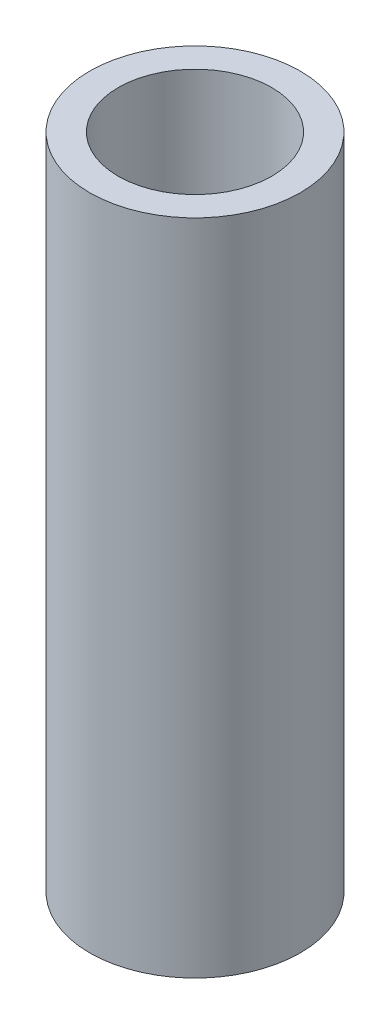
ISO-10303-21;
HEADER;
FILE_DESCRIPTION(('STEP AP214'),'2;1');
FILE_NAME('part.step','',(''),(''),'','','');
FILE_SCHEMA(('AUTOMOTIVE_DESIGN { 1 0 10303 214 1 1 1 1 }'));
ENDSEC;
DATA;
#1=APPLICATION_CONTEXT('core data for automotive mechanical design processes');
#2=APPLICATION_PROTOCOL_DEFINITION('international standard','automotive_design',2000,#1);
#3=PRODUCT_CONTEXT('',#1,'mechanical');
#4=PRODUCT('Part','Part','',(#3));
#5=PRODUCT_RELATED_PRODUCT_CATEGORY('part','',(#4));
#6=PRODUCT_DEFINITION_FORMATION('','',#4);
#7=PRODUCT_DEFINITION_CONTEXT('part definition',#1,'design');
#8=PRODUCT_DEFINITION('design','',#6,#7);
#9=PRODUCT_DEFINITION_SHAPE('','',#8);
#10=(LENGTH_UNIT() NAMED_UNIT(*) SI_UNIT(.MILLI.,.METRE.));
#11=(NAMED_UNIT(*) PLANE_ANGLE_UNIT() SI_UNIT($,.RADIAN.));
#12=(NAMED_UNIT(*) SI_UNIT($,.STERADIAN.) SOLID_ANGLE_UNIT());
#13=UNCERTAINTY_MEASURE_WITH_UNIT(LENGTH_MEASURE(1.E-05),#10,'distance_accuracy_value','');
#14=(GEOMETRIC_REPRESENTATION_CONTEXT(3) GLOBAL_UNCERTAINTY_ASSIGNED_CONTEXT((#13)) GLOBAL_UNIT_ASSIGNED_CONTEXT((#10,
#11,#12)) REPRESENTATION_CONTEXT('',''));
#15=CARTESIAN_POINT('',(0.,0.,0.));
#16=DIRECTION('',(0.,0.,1.));
#17=DIRECTION('',(1.,0.,0.));
#18=AXIS2_PLACEMENT_3D('',#15,#16,#17);
#19=CARTESIAN_POINT('',(0.,15.,0.));
#20=DIRECTION('',(0.,-1.,0.));
#21=DIRECTION('',(0.,0.,-1.));
#22=AXIS2_PLACEMENT_3D('',#19,#20,#21);
#23=CYLINDRICAL_SURFACE('',#22,2.4);
#24=CARTESIAN_POINT('',(0.,15.,0.));
#25=DIRECTION('',(0.,1.,0.));
#26=DIRECTION('',(0.,0.,1.));
#27=AXIS2_PLACEMENT_3D('',#24,#25,#26);
#28=CIRCLE('',#27,2.4);
#29=CARTESIAN_POINT('',(0.,15.,2.4));
#30=VERTEX_POINT('',#29);
#31=EDGE_CURVE('E10',#30,#30,#28,.T.);
#32=ORIENTED_EDGE('',*,*,#31,.F.);
#33=EDGE_LOOP('',(#32));
#34=FACE_BOUND('',#33,.T.);
#35=CARTESIAN_POINT('',(0.,0.,0.));
#36=DIRECTION('',(0.,1.,0.));
#37=DIRECTION('',(0.,0.,1.));
#38=AXIS2_PLACEMENT_3D('',#35,#36,#37);
#39=CIRCLE('',#38,2.4);
#40=CARTESIAN_POINT('',(0.,0.,2.4));
#41=VERTEX_POINT('',#40);
#42=EDGE_CURVE('E44',#41,#41,#39,.T.);
#43=ORIENTED_EDGE('',*,*,#42,.T.);
#44=EDGE_LOOP('',(#43));
#45=FACE_BOUND('',#44,.T.);
#46=ADVANCED_FACE('F41',(#34,#45),#23,.T.);
#47=CARTESIAN_POINT('',(0.,15.,0.));
#48=DIRECTION('',(0.,1.,0.));
#49=DIRECTION('',(0.,0.,1.));
#50=AXIS2_PLACEMENT_3D('',#47,#48,#49);
#51=PLANE('',#50);
#52=CARTESIAN_POINT('',(0.,15.,0.));
#53=DIRECTION('',(0.,1.,0.));
#54=DIRECTION('',(0.,0.,1.));
#55=AXIS2_PLACEMENT_3D('',#52,#53,#54);
#56=CIRCLE('',#55,1.75);
#57=CARTESIAN_POINT('',(0.,15.,1.75));
#58=VERTEX_POINT('',#57);
#59=EDGE_CURVE('E55',#58,#58,#56,.T.);
#60=ORIENTED_EDGE('',*,*,#59,.F.);
#61=EDGE_LOOP('',(#60));
#62=FACE_BOUND('',#61,.T.);
#63=ORIENTED_EDGE('',*,*,#31,.T.);
#64=EDGE_LOOP('',(#63));
#65=FACE_BOUND('',#64,.T.);
#66=ADVANCED_FACE('F72',(#62,#65),#51,.T.);
#67=CARTESIAN_POINT('',(0.,0.,0.));
#68=DIRECTION('',(0.,1.,0.));
#69=DIRECTION('',(0.,0.,1.));
#70=AXIS2_PLACEMENT_3D('',#67,#68,#69);
#71=PLANE('',#70);
#72=CARTESIAN_POINT('',(0.,0.,0.));
#73=DIRECTION('',(0.,1.,0.));
#74=DIRECTION('',(0.,0.,1.));
#75=AXIS2_PLACEMENT_3D('',#72,#73,#74);
#76=CIRCLE('',#75,1.75);
#77=CARTESIAN_POINT('',(0.,0.,1.75));
#78=VERTEX_POINT('',#77);
#79=EDGE_CURVE('E53',#78,#78,#76,.T.);
#80=ORIENTED_EDGE('',*,*,#79,.T.);
#81=EDGE_LOOP('',(#80));
#82=FACE_BOUND('',#81,.T.);
#83=ORIENTED_EDGE('',*,*,#42,.F.);
#84=EDGE_LOOP('',(#83));
#85=FACE_BOUND('',#84,.T.);
#86=ADVANCED_FACE('F63',(#82,#85),#71,.F.);
#87=CARTESIAN_POINT('',(0.,0.,0.));
#88=DIRECTION('',(0.,1.,0.));
#89=DIRECTION('',(0.,0.,1.));
#90=AXIS2_PLACEMENT_3D('',#87,#88,#89);
#91=CYLINDRICAL_SURFACE('',#90,1.75);
#92=ORIENTED_EDGE('',*,*,#79,.F.);
#93=EDGE_LOOP('',(#92));
#94=FACE_BOUND('',#93,.T.);
#95=ORIENTED_EDGE('',*,*,#59,.T.);
#96=EDGE_LOOP('',(#95));
#97=FACE_BOUND('',#96,.T.);
#98=ADVANCED_FACE('F66',(#94,#97),#91,.F.);
#99=CLOSED_SHELL('',(#46,#66,#86,#98));
#100=MANIFOLD_SOLID_BREP('B2',#99);
#101=ADVANCED_BREP_SHAPE_REPRESENTATION('',(#18,#100),#14);
#102=SHAPE_DEFINITION_REPRESENTATION(#9,#101);
ENDSEC;
END-ISO-10303-21;
